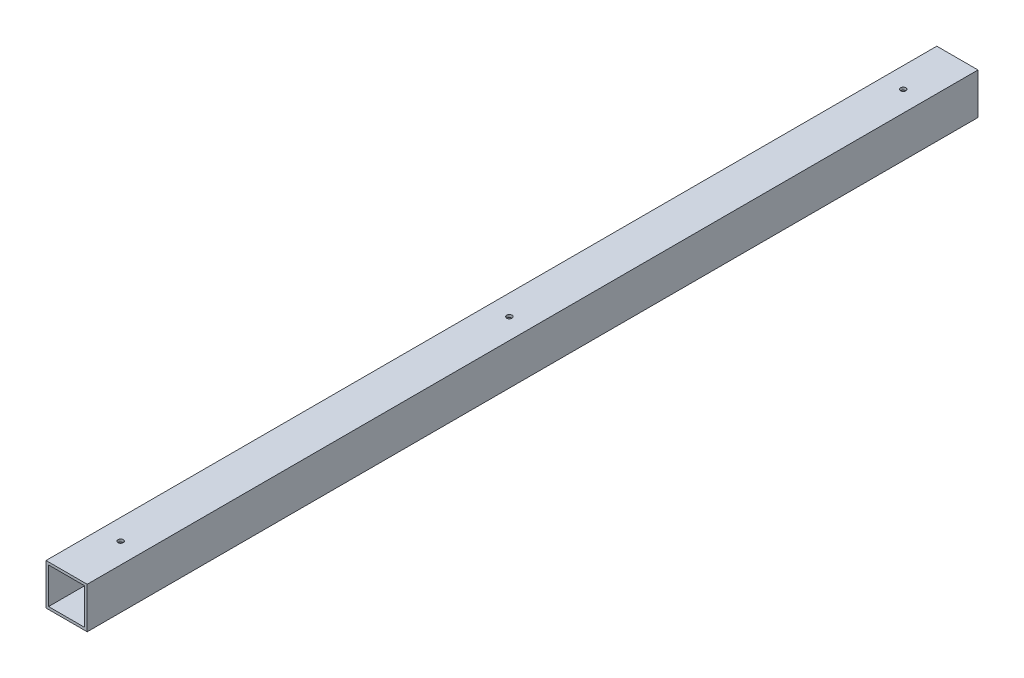
ISO-10303-21;
HEADER;
FILE_DESCRIPTION(('STEP AP214'),'2;1');
FILE_NAME('part.step','',(''),(''),'','','');
FILE_SCHEMA(('AUTOMOTIVE_DESIGN { 1 0 10303 214 1 1 1 1 }'));
ENDSEC;
DATA;
#1=APPLICATION_CONTEXT('core data for automotive mechanical design processes');
#2=APPLICATION_PROTOCOL_DEFINITION('international standard','automotive_design',2000,#1);
#3=PRODUCT_CONTEXT('',#1,'mechanical');
#4=PRODUCT('Part','Part','',(#3));
#5=PRODUCT_RELATED_PRODUCT_CATEGORY('part','',(#4));
#6=PRODUCT_DEFINITION_FORMATION('','',#4);
#7=PRODUCT_DEFINITION_CONTEXT('part definition',#1,'design');
#8=PRODUCT_DEFINITION('design','',#6,#7);
#9=PRODUCT_DEFINITION_SHAPE('','',#8);
#10=(LENGTH_UNIT() NAMED_UNIT(*) SI_UNIT(.MILLI.,.METRE.));
#11=(NAMED_UNIT(*) PLANE_ANGLE_UNIT() SI_UNIT($,.RADIAN.));
#12=(NAMED_UNIT(*) SI_UNIT($,.STERADIAN.) SOLID_ANGLE_UNIT());
#13=UNCERTAINTY_MEASURE_WITH_UNIT(LENGTH_MEASURE(1.E-05),#10,'distance_accuracy_value','');
#14=(GEOMETRIC_REPRESENTATION_CONTEXT(3) GLOBAL_UNCERTAINTY_ASSIGNED_CONTEXT((#13)) GLOBAL_UNIT_ASSIGNED_CONTEXT((#10,
#11,#12)) REPRESENTATION_CONTEXT('',''));
#15=CARTESIAN_POINT('',(0.,0.,0.));
#16=DIRECTION('',(0.,0.,1.));
#17=DIRECTION('',(1.,0.,0.));
#18=AXIS2_PLACEMENT_3D('',#15,#16,#17);
#19=CARTESIAN_POINT('',(0.,0.,1098.55));
#20=DIRECTION('',(0.,0.,-1.));
#21=DIRECTION('',(-1.,0.,0.));
#22=AXIS2_PLACEMENT_3D('',#19,#20,#21);
#23=PLANE('',#22);
#24=DIRECTION('',(0.,-1.,0.));
#25=VECTOR('',#24,1.);
#26=CARTESIAN_POINT('',(2314.13118314554,3.88578058618805E-13,1098.55));
#27=LINE('',#26,#25);
#28=CARTESIAN_POINT('',(2314.13118314554,50.8000000000004,1098.55));
#29=VERTEX_POINT('',#28);
#30=CARTESIAN_POINT('',(2314.13118314554,3.88578058618805E-13,1098.55));
#31=VERTEX_POINT('',#30);
#32=EDGE_CURVE('E138',#29,#31,#27,.T.);
#33=ORIENTED_EDGE('',*,*,#32,.T.);
#34=DIRECTION('',(1.,0.,0.));
#35=VECTOR('',#34,1.);
#36=CARTESIAN_POINT('',(2314.13118314554,3.88578058618805E-13,1098.55));
#37=LINE('',#36,#35);
#38=CARTESIAN_POINT('',(2364.93118314554,3.88578058618805E-13,1098.55));
#39=VERTEX_POINT('',#38);
#40=EDGE_CURVE('E141',#31,#39,#37,.T.);
#41=ORIENTED_EDGE('',*,*,#40,.T.);
#42=DIRECTION('',(0.,1.,0.));
#43=VECTOR('',#42,1.);
#44=CARTESIAN_POINT('',(2364.93118314554,3.88578058618805E-13,1098.55));
#45=LINE('',#44,#43);
#46=CARTESIAN_POINT('',(2364.93118314554,50.8000000000004,1098.55));
#47=VERTEX_POINT('',#46);
#48=EDGE_CURVE('E144',#39,#47,#45,.T.);
#49=ORIENTED_EDGE('',*,*,#48,.T.);
#50=DIRECTION('',(-1.,0.,0.));
#51=VECTOR('',#50,1.);
#52=CARTESIAN_POINT('',(2314.13118314554,50.8000000000004,1098.55));
#53=LINE('',#52,#51);
#54=EDGE_CURVE('E146',#47,#29,#53,.T.);
#55=ORIENTED_EDGE('',*,*,#54,.T.);
#56=EDGE_LOOP('',(#33,#41,#49,#55));
#57=FACE_BOUND('',#56,.T.);
#58=DIRECTION('',(1.,0.,0.));
#59=VECTOR('',#58,1.);
#60=CARTESIAN_POINT('',(2317.30618314554,3.1750000000004,1098.55));
#61=LINE('',#60,#59);
#62=CARTESIAN_POINT('',(2317.30618314554,3.1750000000004,1098.55));
#63=VERTEX_POINT('',#62);
#64=CARTESIAN_POINT('',(2361.75618314554,3.1750000000004,1098.55));
#65=VERTEX_POINT('',#64);
#66=EDGE_CURVE('E100',#63,#65,#61,.T.);
#67=ORIENTED_EDGE('',*,*,#66,.F.);
#68=DIRECTION('',(0.,-1.,0.));
#69=VECTOR('',#68,1.);
#70=CARTESIAN_POINT('',(2317.30618314554,3.1750000000004,1098.55));
#71=LINE('',#70,#69);
#72=CARTESIAN_POINT('',(2317.30618314554,47.6250000000004,1098.55));
#73=VERTEX_POINT('',#72);
#74=EDGE_CURVE('E122',#73,#63,#71,.T.);
#75=ORIENTED_EDGE('',*,*,#74,.F.);
#76=DIRECTION('',(-1.,0.,0.));
#77=VECTOR('',#76,1.);
#78=CARTESIAN_POINT('',(2317.30618314554,47.6250000000004,1098.55));
#79=LINE('',#78,#77);
#80=CARTESIAN_POINT('',(2361.75618314554,47.6250000000004,1098.55));
#81=VERTEX_POINT('',#80);
#82=EDGE_CURVE('E120',#81,#73,#79,.T.);
#83=ORIENTED_EDGE('',*,*,#82,.F.);
#84=DIRECTION('',(0.,1.,0.));
#85=VECTOR('',#84,1.);
#86=CARTESIAN_POINT('',(2361.75618314554,3.1750000000004,1098.55));
#87=LINE('',#86,#85);
#88=EDGE_CURVE('E108',#65,#81,#87,.T.);
#89=ORIENTED_EDGE('',*,*,#88,.F.);
#90=EDGE_LOOP('',(#67,#75,#83,#89));
#91=FACE_BOUND('',#90,.T.);
#92=ADVANCED_FACE('F33',(#57,#91),#23,.F.);
#93=CARTESIAN_POINT('',(0.,0.,0.));
#94=DIRECTION('',(0.,0.,-1.));
#95=DIRECTION('',(-1.,0.,0.));
#96=AXIS2_PLACEMENT_3D('',#93,#94,#95);
#97=PLANE('',#96);
#98=DIRECTION('',(0.,-1.,0.));
#99=VECTOR('',#98,1.);
#100=CARTESIAN_POINT('',(2314.13118314554,3.88578058618805E-13,0.));
#101=LINE('',#100,#99);
#102=CARTESIAN_POINT('',(2314.13118314554,50.8000000000004,0.));
#103=VERTEX_POINT('',#102);
#104=CARTESIAN_POINT('',(2314.13118314554,3.88578058618805E-13,0.));
#105=VERTEX_POINT('',#104);
#106=EDGE_CURVE('E116',#103,#105,#101,.T.);
#107=ORIENTED_EDGE('',*,*,#106,.F.);
#108=DIRECTION('',(-1.,0.,0.));
#109=VECTOR('',#108,1.);
#110=CARTESIAN_POINT('',(2314.13118314554,50.8000000000004,0.));
#111=LINE('',#110,#109);
#112=CARTESIAN_POINT('',(2364.93118314554,50.8000000000004,0.));
#113=VERTEX_POINT('',#112);
#114=EDGE_CURVE('E142',#113,#103,#111,.T.);
#115=ORIENTED_EDGE('',*,*,#114,.F.);
#116=DIRECTION('',(0.,1.,0.));
#117=VECTOR('',#116,1.);
#118=CARTESIAN_POINT('',(2364.93118314554,3.88578058618805E-13,0.));
#119=LINE('',#118,#117);
#120=CARTESIAN_POINT('',(2364.93118314554,3.88578058618805E-13,0.));
#121=VERTEX_POINT('',#120);
#122=EDGE_CURVE('E153',#121,#113,#119,.T.);
#123=ORIENTED_EDGE('',*,*,#122,.F.);
#124=DIRECTION('',(1.,0.,0.));
#125=VECTOR('',#124,1.);
#126=CARTESIAN_POINT('',(2314.13118314554,3.88578058618805E-13,0.));
#127=LINE('',#126,#125);
#128=EDGE_CURVE('E151',#105,#121,#127,.T.);
#129=ORIENTED_EDGE('',*,*,#128,.F.);
#130=EDGE_LOOP('',(#107,#115,#123,#129));
#131=FACE_BOUND('',#130,.T.);
#132=DIRECTION('',(0.,-1.,0.));
#133=VECTOR('',#132,1.);
#134=CARTESIAN_POINT('',(2317.30618314554,3.1750000000004,0.));
#135=LINE('',#134,#133);
#136=CARTESIAN_POINT('',(2317.30618314554,47.6250000000004,0.));
#137=VERTEX_POINT('',#136);
#138=CARTESIAN_POINT('',(2317.30618314554,3.1750000000004,0.));
#139=VERTEX_POINT('',#138);
#140=EDGE_CURVE('E109',#137,#139,#135,.T.);
#141=ORIENTED_EDGE('',*,*,#140,.T.);
#142=DIRECTION('',(1.,0.,0.));
#143=VECTOR('',#142,1.);
#144=CARTESIAN_POINT('',(2317.30618314554,3.1750000000004,0.));
#145=LINE('',#144,#143);
#146=CARTESIAN_POINT('',(2361.75618314554,3.1750000000004,0.));
#147=VERTEX_POINT('',#146);
#148=EDGE_CURVE('E58',#139,#147,#145,.T.);
#149=ORIENTED_EDGE('',*,*,#148,.T.);
#150=DIRECTION('',(0.,1.,0.));
#151=VECTOR('',#150,1.);
#152=CARTESIAN_POINT('',(2361.75618314554,3.1750000000004,0.));
#153=LINE('',#152,#151);
#154=CARTESIAN_POINT('',(2361.75618314554,47.6250000000004,0.));
#155=VERTEX_POINT('',#154);
#156=EDGE_CURVE('E115',#147,#155,#153,.T.);
#157=ORIENTED_EDGE('',*,*,#156,.T.);
#158=DIRECTION('',(-1.,0.,0.));
#159=VECTOR('',#158,1.);
#160=CARTESIAN_POINT('',(2317.30618314554,47.6250000000004,0.));
#161=LINE('',#160,#159);
#162=EDGE_CURVE('E130',#155,#137,#161,.T.);
#163=ORIENTED_EDGE('',*,*,#162,.T.);
#164=EDGE_LOOP('',(#141,#149,#157,#163));
#165=FACE_BOUND('',#164,.T.);
#166=ADVANCED_FACE('F200',(#131,#165),#97,.T.);
#167=CARTESIAN_POINT('',(2314.13118314554,3.88578058618805E-13,1098.55));
#168=DIRECTION('',(1.,0.,0.));
#169=DIRECTION('',(0.,0.,-1.));
#170=AXIS2_PLACEMENT_3D('',#167,#168,#169);
#171=PLANE('',#170);
#172=ORIENTED_EDGE('',*,*,#106,.T.);
#173=DIRECTION('',(0.,0.,-1.));
#174=VECTOR('',#173,1.);
#175=CARTESIAN_POINT('',(2314.13118314554,3.88578058618805E-13,1098.55));
#176=LINE('',#175,#174);
#177=EDGE_CURVE('E11',#31,#105,#176,.T.);
#178=ORIENTED_EDGE('',*,*,#177,.F.);
#179=ORIENTED_EDGE('',*,*,#32,.F.);
#180=DIRECTION('',(0.,0.,-1.));
#181=VECTOR('',#180,1.);
#182=CARTESIAN_POINT('',(2314.13118314554,50.8000000000004,1098.55));
#183=LINE('',#182,#181);
#184=EDGE_CURVE('E148',#29,#103,#183,.T.);
#185=ORIENTED_EDGE('',*,*,#184,.T.);
#186=EDGE_LOOP('',(#172,#178,#179,#185));
#187=FACE_BOUND('',#186,.T.);
#188=ADVANCED_FACE('F35',(#187),#171,.F.);
#189=CARTESIAN_POINT('',(2314.13118314554,3.88578058618805E-13,1098.55));
#190=DIRECTION('',(0.,1.,0.));
#191=DIRECTION('',(0.,0.,1.));
#192=AXIS2_PLACEMENT_3D('',#189,#190,#191);
#193=PLANE('',#192);
#194=CARTESIAN_POINT('',(2339.53118314554,3.88578058618805E-13,66.802));
#195=DIRECTION('',(0.,1.,0.));
#196=DIRECTION('',(0.,0.,-1.));
#197=AXIS2_PLACEMENT_3D('',#194,#195,#196);
#198=CIRCLE('',#197,3.30200000000026);
#199=CARTESIAN_POINT('',(2339.53118314554,3.88578058618805E-13,63.4999999999998));
#200=VERTEX_POINT('',#199);
#201=EDGE_CURVE('E239',#200,#200,#198,.T.);
#202=ORIENTED_EDGE('',*,*,#201,.T.);
#203=EDGE_LOOP('',(#202));
#204=FACE_BOUND('',#203,.T.);
#205=CARTESIAN_POINT('',(2339.53118314554,3.88578058618805E-13,1031.875));
#206=DIRECTION('',(0.,1.,0.));
#207=DIRECTION('',(0.,0.,1.));
#208=AXIS2_PLACEMENT_3D('',#205,#206,#207);
#209=CIRCLE('',#208,3.30200000000027);
#210=CARTESIAN_POINT('',(2339.53118314554,3.88578058618805E-13,1035.177));
#211=VERTEX_POINT('',#210);
#212=EDGE_CURVE('E243',#211,#211,#209,.T.);
#213=ORIENTED_EDGE('',*,*,#212,.T.);
#214=EDGE_LOOP('',(#213));
#215=FACE_BOUND('',#214,.T.);
#216=CARTESIAN_POINT('',(2339.53118314554,3.88578058618805E-13,552.450000000009));
#217=DIRECTION('',(0.,1.,0.));
#218=DIRECTION('',(0.,0.,1.));
#219=AXIS2_PLACEMENT_3D('',#216,#217,#218);
#220=CIRCLE('',#219,3.30200000000027);
#221=CARTESIAN_POINT('',(2339.53118314554,3.88578058618805E-13,555.75200000001));
#222=VERTEX_POINT('',#221);
#223=EDGE_CURVE('E166',#222,#222,#220,.T.);
#224=ORIENTED_EDGE('',*,*,#223,.T.);
#225=EDGE_LOOP('',(#224));
#226=FACE_BOUND('',#225,.T.);
#227=ORIENTED_EDGE('',*,*,#128,.T.);
#228=DIRECTION('',(0.,0.,-1.));
#229=VECTOR('',#228,1.);
#230=CARTESIAN_POINT('',(2364.93118314554,3.88578058618805E-13,1098.55));
#231=LINE('',#230,#229);
#232=EDGE_CURVE('E42',#39,#121,#231,.T.);
#233=ORIENTED_EDGE('',*,*,#232,.F.);
#234=ORIENTED_EDGE('',*,*,#40,.F.);
#235=ORIENTED_EDGE('',*,*,#177,.T.);
#236=EDGE_LOOP('',(#227,#233,#234,#235));
#237=FACE_BOUND('',#236,.T.);
#238=ADVANCED_FACE('F228',(#204,#215,#226,#237),#193,.F.);
#239=CARTESIAN_POINT('',(2364.93118314554,3.88578058618805E-13,1098.55));
#240=DIRECTION('',(-1.,0.,0.));
#241=DIRECTION('',(0.,0.,1.));
#242=AXIS2_PLACEMENT_3D('',#239,#240,#241);
#243=PLANE('',#242);
#244=ORIENTED_EDGE('',*,*,#122,.T.);
#245=DIRECTION('',(0.,0.,-1.));
#246=VECTOR('',#245,1.);
#247=CARTESIAN_POINT('',(2364.93118314554,50.8000000000004,1098.55));
#248=LINE('',#247,#246);
#249=EDGE_CURVE('E158',#47,#113,#248,.T.);
#250=ORIENTED_EDGE('',*,*,#249,.F.);
#251=ORIENTED_EDGE('',*,*,#48,.F.);
#252=ORIENTED_EDGE('',*,*,#232,.T.);
#253=EDGE_LOOP('',(#244,#250,#251,#252));
#254=FACE_BOUND('',#253,.T.);
#255=ADVANCED_FACE('F225',(#254),#243,.F.);
#256=CARTESIAN_POINT('',(2314.13118314554,50.8000000000004,1098.55));
#257=DIRECTION('',(0.,-1.,0.));
#258=DIRECTION('',(0.,0.,-1.));
#259=AXIS2_PLACEMENT_3D('',#256,#257,#258);
#260=PLANE('',#259);
#261=CARTESIAN_POINT('',(2339.53118314554,50.8000000000004,66.802));
#262=DIRECTION('',(0.,1.,0.));
#263=DIRECTION('',(0.,0.,-1.));
#264=AXIS2_PLACEMENT_3D('',#261,#262,#263);
#265=CIRCLE('',#264,3.30200000000026);
#266=CARTESIAN_POINT('',(2339.53118314554,50.8000000000004,63.4999999999998));
#267=VERTEX_POINT('',#266);
#268=EDGE_CURVE('E261',#267,#267,#265,.T.);
#269=ORIENTED_EDGE('',*,*,#268,.F.);
#270=EDGE_LOOP('',(#269));
#271=FACE_BOUND('',#270,.T.);
#272=CARTESIAN_POINT('',(2339.53118314554,50.8000000000004,1031.875));
#273=DIRECTION('',(0.,1.,0.));
#274=DIRECTION('',(0.,0.,1.));
#275=AXIS2_PLACEMENT_3D('',#272,#273,#274);
#276=CIRCLE('',#275,3.30200000000027);
#277=CARTESIAN_POINT('',(2339.53118314554,50.8000000000004,1035.177));
#278=VERTEX_POINT('',#277);
#279=EDGE_CURVE('E265',#278,#278,#276,.T.);
#280=ORIENTED_EDGE('',*,*,#279,.F.);
#281=EDGE_LOOP('',(#280));
#282=FACE_BOUND('',#281,.T.);
#283=CARTESIAN_POINT('',(2339.53118314554,50.8000000000004,552.450000000009));
#284=DIRECTION('',(0.,1.,0.));
#285=DIRECTION('',(0.,0.,1.));
#286=AXIS2_PLACEMENT_3D('',#283,#284,#285);
#287=CIRCLE('',#286,3.30200000000027);
#288=CARTESIAN_POINT('',(2339.53118314554,50.8000000000004,555.75200000001));
#289=VERTEX_POINT('',#288);
#290=EDGE_CURVE('E179',#289,#289,#287,.T.);
#291=ORIENTED_EDGE('',*,*,#290,.F.);
#292=EDGE_LOOP('',(#291));
#293=FACE_BOUND('',#292,.T.);
#294=ORIENTED_EDGE('',*,*,#114,.T.);
#295=ORIENTED_EDGE('',*,*,#184,.F.);
#296=ORIENTED_EDGE('',*,*,#54,.F.);
#297=ORIENTED_EDGE('',*,*,#249,.T.);
#298=EDGE_LOOP('',(#294,#295,#296,#297));
#299=FACE_BOUND('',#298,.T.);
#300=ADVANCED_FACE('F222',(#271,#282,#293,#299),#260,.F.);
#301=CARTESIAN_POINT('',(2317.30618314554,3.1750000000004,1098.55));
#302=DIRECTION('',(0.,1.,0.));
#303=DIRECTION('',(0.,0.,1.));
#304=AXIS2_PLACEMENT_3D('',#301,#302,#303);
#305=PLANE('',#304);
#306=CARTESIAN_POINT('',(2339.53118314554,3.1750000000004,66.802));
#307=DIRECTION('',(0.,1.,0.));
#308=DIRECTION('',(0.,0.,1.));
#309=AXIS2_PLACEMENT_3D('',#306,#307,#308);
#310=CIRCLE('',#309,3.30200000000026);
#311=CARTESIAN_POINT('',(2339.53118314554,3.1750000000004,70.1040000000003));
#312=VERTEX_POINT('',#311);
#313=EDGE_CURVE('E128',#312,#312,#310,.T.);
#314=ORIENTED_EDGE('',*,*,#313,.F.);
#315=EDGE_LOOP('',(#314));
#316=FACE_BOUND('',#315,.T.);
#317=CARTESIAN_POINT('',(2339.53118314554,3.1750000000004,1031.875));
#318=DIRECTION('',(0.,1.,0.));
#319=DIRECTION('',(0.,0.,1.));
#320=AXIS2_PLACEMENT_3D('',#317,#318,#319);
#321=CIRCLE('',#320,3.30200000000027);
#322=CARTESIAN_POINT('',(2339.53118314554,3.1750000000004,1035.177));
#323=VERTEX_POINT('',#322);
#324=EDGE_CURVE('E169',#323,#323,#321,.T.);
#325=ORIENTED_EDGE('',*,*,#324,.F.);
#326=EDGE_LOOP('',(#325));
#327=FACE_BOUND('',#326,.T.);
#328=CARTESIAN_POINT('',(2339.53118314554,3.1750000000004,552.450000000009));
#329=DIRECTION('',(0.,1.,0.));
#330=DIRECTION('',(0.,0.,1.));
#331=AXIS2_PLACEMENT_3D('',#328,#329,#330);
#332=CIRCLE('',#331,3.30200000000027);
#333=CARTESIAN_POINT('',(2339.53118314554,3.1750000000004,555.75200000001));
#334=VERTEX_POINT('',#333);
#335=EDGE_CURVE('E165',#334,#334,#332,.T.);
#336=ORIENTED_EDGE('',*,*,#335,.F.);
#337=EDGE_LOOP('',(#336));
#338=FACE_BOUND('',#337,.T.);
#339=ORIENTED_EDGE('',*,*,#148,.F.);
#340=DIRECTION('',(0.,0.,-1.));
#341=VECTOR('',#340,1.);
#342=CARTESIAN_POINT('',(2317.30618314554,3.1750000000004,1098.55));
#343=LINE('',#342,#341);
#344=EDGE_CURVE('E104',#63,#139,#343,.T.);
#345=ORIENTED_EDGE('',*,*,#344,.F.);
#346=ORIENTED_EDGE('',*,*,#66,.T.);
#347=DIRECTION('',(0.,0.,-1.));
#348=VECTOR('',#347,1.);
#349=CARTESIAN_POINT('',(2361.75618314554,3.1750000000004,1098.55));
#350=LINE('',#349,#348);
#351=EDGE_CURVE('E103',#65,#147,#350,.T.);
#352=ORIENTED_EDGE('',*,*,#351,.T.);
#353=EDGE_LOOP('',(#339,#345,#346,#352));
#354=FACE_BOUND('',#353,.T.);
#355=ADVANCED_FACE('F102',(#316,#327,#338,#354),#305,.T.);
#356=CARTESIAN_POINT('',(2361.75618314554,3.1750000000004,1098.55));
#357=DIRECTION('',(-1.,0.,0.));
#358=DIRECTION('',(0.,0.,1.));
#359=AXIS2_PLACEMENT_3D('',#356,#357,#358);
#360=PLANE('',#359);
#361=ORIENTED_EDGE('',*,*,#156,.F.);
#362=ORIENTED_EDGE('',*,*,#351,.F.);
#363=ORIENTED_EDGE('',*,*,#88,.T.);
#364=DIRECTION('',(0.,0.,-1.));
#365=VECTOR('',#364,1.);
#366=CARTESIAN_POINT('',(2361.75618314554,47.6250000000004,1098.55));
#367=LINE('',#366,#365);
#368=EDGE_CURVE('E117',#81,#155,#367,.T.);
#369=ORIENTED_EDGE('',*,*,#368,.T.);
#370=EDGE_LOOP('',(#361,#362,#363,#369));
#371=FACE_BOUND('',#370,.T.);
#372=ADVANCED_FACE('F112',(#371),#360,.T.);
#373=CARTESIAN_POINT('',(2317.30618314554,47.6250000000004,1098.55));
#374=DIRECTION('',(0.,-1.,0.));
#375=DIRECTION('',(0.,0.,-1.));
#376=AXIS2_PLACEMENT_3D('',#373,#374,#375);
#377=PLANE('',#376);
#378=CARTESIAN_POINT('',(2339.53118314554,47.6250000000004,66.802));
#379=DIRECTION('',(0.,-1.,0.));
#380=DIRECTION('',(0.,0.,-1.));
#381=AXIS2_PLACEMENT_3D('',#378,#379,#380);
#382=CIRCLE('',#381,3.30200000000026);
#383=CARTESIAN_POINT('',(2339.53118314554,47.6250000000004,63.4999999999998));
#384=VERTEX_POINT('',#383);
#385=EDGE_CURVE('E37',#384,#384,#382,.T.);
#386=ORIENTED_EDGE('',*,*,#385,.F.);
#387=EDGE_LOOP('',(#386));
#388=FACE_BOUND('',#387,.T.);
#389=CARTESIAN_POINT('',(2339.53118314554,47.6250000000004,1031.875));
#390=DIRECTION('',(0.,-1.,0.));
#391=DIRECTION('',(0.,0.,-1.));
#392=AXIS2_PLACEMENT_3D('',#389,#390,#391);
#393=CIRCLE('',#392,3.30200000000027);
#394=CARTESIAN_POINT('',(2339.53118314554,47.6250000000004,1028.573));
#395=VERTEX_POINT('',#394);
#396=EDGE_CURVE('E167',#395,#395,#393,.T.);
#397=ORIENTED_EDGE('',*,*,#396,.F.);
#398=EDGE_LOOP('',(#397));
#399=FACE_BOUND('',#398,.T.);
#400=CARTESIAN_POINT('',(2339.53118314554,47.6250000000004,552.450000000009));
#401=DIRECTION('',(0.,-1.,0.));
#402=DIRECTION('',(0.,0.,-1.));
#403=AXIS2_PLACEMENT_3D('',#400,#401,#402);
#404=CIRCLE('',#403,3.30200000000027);
#405=CARTESIAN_POINT('',(2339.53118314554,47.6250000000004,549.148000000009));
#406=VERTEX_POINT('',#405);
#407=EDGE_CURVE('E163',#406,#406,#404,.T.);
#408=ORIENTED_EDGE('',*,*,#407,.F.);
#409=EDGE_LOOP('',(#408));
#410=FACE_BOUND('',#409,.T.);
#411=ORIENTED_EDGE('',*,*,#162,.F.);
#412=ORIENTED_EDGE('',*,*,#368,.F.);
#413=ORIENTED_EDGE('',*,*,#82,.T.);
#414=DIRECTION('',(0.,0.,-1.));
#415=VECTOR('',#414,1.);
#416=CARTESIAN_POINT('',(2317.30618314554,47.6250000000004,1098.55));
#417=LINE('',#416,#415);
#418=EDGE_CURVE('E50',#73,#137,#417,.T.);
#419=ORIENTED_EDGE('',*,*,#418,.T.);
#420=EDGE_LOOP('',(#411,#412,#413,#419));
#421=FACE_BOUND('',#420,.T.);
#422=ADVANCED_FACE('F190',(#388,#399,#410,#421),#377,.T.);
#423=CARTESIAN_POINT('',(2317.30618314554,3.1750000000004,1098.55));
#424=DIRECTION('',(1.,0.,0.));
#425=DIRECTION('',(0.,0.,-1.));
#426=AXIS2_PLACEMENT_3D('',#423,#424,#425);
#427=PLANE('',#426);
#428=ORIENTED_EDGE('',*,*,#140,.F.);
#429=ORIENTED_EDGE('',*,*,#418,.F.);
#430=ORIENTED_EDGE('',*,*,#74,.T.);
#431=ORIENTED_EDGE('',*,*,#344,.T.);
#432=EDGE_LOOP('',(#428,#429,#430,#431));
#433=FACE_BOUND('',#432,.T.);
#434=ADVANCED_FACE('F193',(#433),#427,.T.);
#435=CARTESIAN_POINT('',(2339.53118314554,3.88578058618805E-13,552.450000000009));
#436=DIRECTION('',(0.,1.,0.));
#437=DIRECTION('',(0.,0.,1.));
#438=AXIS2_PLACEMENT_3D('',#435,#436,#437);
#439=CYLINDRICAL_SURFACE('',#438,3.30200000000027);
#440=ORIENTED_EDGE('',*,*,#407,.T.);
#441=EDGE_LOOP('',(#440));
#442=FACE_BOUND('',#441,.T.);
#443=ORIENTED_EDGE('',*,*,#290,.T.);
#444=EDGE_LOOP('',(#443));
#445=FACE_BOUND('',#444,.T.);
#446=ADVANCED_FACE('F202',(#442,#445),#439,.F.);
#447=CARTESIAN_POINT('',(2339.53118314554,3.88578058618805E-13,1031.875));
#448=DIRECTION('',(0.,1.,0.));
#449=DIRECTION('',(0.,0.,1.));
#450=AXIS2_PLACEMENT_3D('',#447,#448,#449);
#451=CYLINDRICAL_SURFACE('',#450,3.30200000000027);
#452=ORIENTED_EDGE('',*,*,#396,.T.);
#453=EDGE_LOOP('',(#452));
#454=FACE_BOUND('',#453,.T.);
#455=ORIENTED_EDGE('',*,*,#279,.T.);
#456=EDGE_LOOP('',(#455));
#457=FACE_BOUND('',#456,.T.);
#458=ADVANCED_FACE('F207',(#454,#457),#451,.F.);
#459=CARTESIAN_POINT('',(2339.53118314554,3.88578058618805E-13,66.802));
#460=DIRECTION('',(0.,1.,0.));
#461=DIRECTION('',(0.,0.,1.));
#462=AXIS2_PLACEMENT_3D('',#459,#460,#461);
#463=CYLINDRICAL_SURFACE('',#462,3.30200000000026);
#464=ORIENTED_EDGE('',*,*,#385,.T.);
#465=EDGE_LOOP('',(#464));
#466=FACE_BOUND('',#465,.T.);
#467=ORIENTED_EDGE('',*,*,#268,.T.);
#468=EDGE_LOOP('',(#467));
#469=FACE_BOUND('',#468,.T.);
#470=ADVANCED_FACE('F187',(#466,#469),#463,.F.);
#471=ORIENTED_EDGE('',*,*,#335,.T.);
#472=EDGE_LOOP('',(#471));
#473=FACE_BOUND('',#472,.T.);
#474=ORIENTED_EDGE('',*,*,#223,.F.);
#475=EDGE_LOOP('',(#474));
#476=FACE_BOUND('',#475,.T.);
#477=ADVANCED_FACE('F210',(#473,#476),#439,.F.);
#478=ORIENTED_EDGE('',*,*,#324,.T.);
#479=EDGE_LOOP('',(#478));
#480=FACE_BOUND('',#479,.T.);
#481=ORIENTED_EDGE('',*,*,#212,.F.);
#482=EDGE_LOOP('',(#481));
#483=FACE_BOUND('',#482,.T.);
#484=ADVANCED_FACE('F276',(#480,#483),#451,.F.);
#485=ORIENTED_EDGE('',*,*,#313,.T.);
#486=EDGE_LOOP('',(#485));
#487=FACE_BOUND('',#486,.T.);
#488=ORIENTED_EDGE('',*,*,#201,.F.);
#489=EDGE_LOOP('',(#488));
#490=FACE_BOUND('',#489,.T.);
#491=ADVANCED_FACE('F281',(#487,#490),#463,.F.);
#492=CLOSED_SHELL('',(#92,#166,#188,#238,#255,#300,#355,#372,#422,#434,#446,#458,#470,#477,#484,#491));
#493=MANIFOLD_SOLID_BREP('B2',#492);
#494=ADVANCED_BREP_SHAPE_REPRESENTATION('',(#18,#493),#14);
#495=SHAPE_DEFINITION_REPRESENTATION(#9,#494);
ENDSEC;
END-ISO-10303-21;
